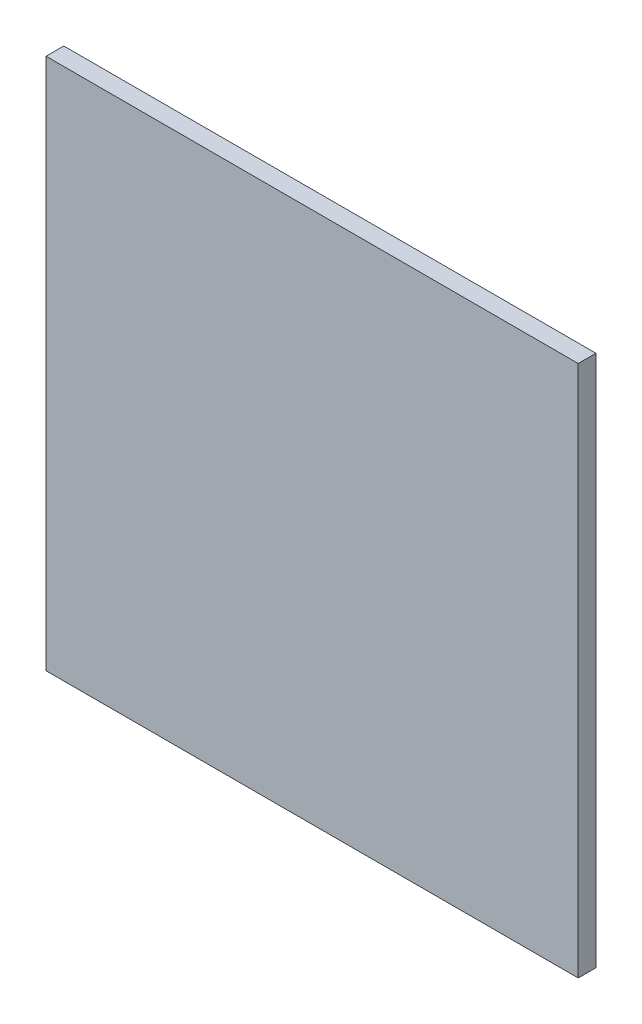
ISO-10303-21;
HEADER;
FILE_DESCRIPTION(('STEP AP214'),'2;1');
FILE_NAME('part.step','',(''),(''),'','','');
FILE_SCHEMA(('AUTOMOTIVE_DESIGN { 1 0 10303 214 1 1 1 1 }'));
ENDSEC;
DATA;
#1=APPLICATION_CONTEXT('core data for automotive mechanical design processes');
#2=APPLICATION_PROTOCOL_DEFINITION('international standard','automotive_design',2000,#1);
#3=PRODUCT_CONTEXT('',#1,'mechanical');
#4=PRODUCT('Part','Part','',(#3));
#5=PRODUCT_RELATED_PRODUCT_CATEGORY('part','',(#4));
#6=PRODUCT_DEFINITION_FORMATION('','',#4);
#7=PRODUCT_DEFINITION_CONTEXT('part definition',#1,'design');
#8=PRODUCT_DEFINITION('design','',#6,#7);
#9=PRODUCT_DEFINITION_SHAPE('','',#8);
#10=(LENGTH_UNIT() NAMED_UNIT(*) SI_UNIT(.MILLI.,.METRE.));
#11=(NAMED_UNIT(*) PLANE_ANGLE_UNIT() SI_UNIT($,.RADIAN.));
#12=(NAMED_UNIT(*) SI_UNIT($,.STERADIAN.) SOLID_ANGLE_UNIT());
#13=UNCERTAINTY_MEASURE_WITH_UNIT(LENGTH_MEASURE(1.E-05),#10,'distance_accuracy_value','');
#14=(GEOMETRIC_REPRESENTATION_CONTEXT(3) GLOBAL_UNCERTAINTY_ASSIGNED_CONTEXT((#13)) GLOBAL_UNIT_ASSIGNED_CONTEXT((#10,
#11,#12)) REPRESENTATION_CONTEXT('',''));
#15=CARTESIAN_POINT('',(0.,0.,0.));
#16=DIRECTION('',(0.,0.,1.));
#17=DIRECTION('',(1.,0.,0.));
#18=AXIS2_PLACEMENT_3D('',#15,#16,#17);
#19=CARTESIAN_POINT('',(1100.,-90.,3.));
#20=DIRECTION('',(-1.,0.,0.));
#21=DIRECTION('',(0.,0.,1.));
#22=AXIS2_PLACEMENT_3D('',#19,#20,#21);
#23=PLANE('',#22);
#24=DIRECTION('',(0.,1.,0.));
#25=VECTOR('',#24,1.);
#26=CARTESIAN_POINT('',(1100.,-90.,0.));
#27=LINE('',#26,#25);
#28=CARTESIAN_POINT('',(1100.,-90.,0.));
#29=VERTEX_POINT('',#28);
#30=CARTESIAN_POINT('',(1100.,0.,0.));
#31=VERTEX_POINT('',#30);
#32=EDGE_CURVE('E97',#29,#31,#27,.T.);
#33=ORIENTED_EDGE('',*,*,#32,.T.);
#34=DIRECTION('',(0.,0.,-1.));
#35=VECTOR('',#34,1.);
#36=CARTESIAN_POINT('',(1100.,0.,3.));
#37=LINE('',#36,#35);
#38=CARTESIAN_POINT('',(1100.,0.,3.));
#39=VERTEX_POINT('',#38);
#40=EDGE_CURVE('E11',#39,#31,#37,.T.);
#41=ORIENTED_EDGE('',*,*,#40,.F.);
#42=DIRECTION('',(0.,1.,0.));
#43=VECTOR('',#42,1.);
#44=CARTESIAN_POINT('',(1100.,-90.,3.));
#45=LINE('',#44,#43);
#46=CARTESIAN_POINT('',(1100.,-90.,3.));
#47=VERTEX_POINT('',#46);
#48=EDGE_CURVE('E85',#47,#39,#45,.T.);
#49=ORIENTED_EDGE('',*,*,#48,.F.);
#50=DIRECTION('',(0.,0.,-1.));
#51=VECTOR('',#50,1.);
#52=CARTESIAN_POINT('',(1100.,-90.,3.));
#53=LINE('',#52,#51);
#54=EDGE_CURVE('E93',#47,#29,#53,.T.);
#55=ORIENTED_EDGE('',*,*,#54,.T.);
#56=EDGE_LOOP('',(#33,#41,#49,#55));
#57=FACE_BOUND('',#56,.T.);
#58=ADVANCED_FACE('F34',(#57),#23,.F.);
#59=CARTESIAN_POINT('',(1100.,0.,3.));
#60=DIRECTION('',(0.,-1.,0.));
#61=DIRECTION('',(0.,0.,-1.));
#62=AXIS2_PLACEMENT_3D('',#59,#60,#61);
#63=PLANE('',#62);
#64=DIRECTION('',(-1.,0.,0.));
#65=VECTOR('',#64,1.);
#66=CARTESIAN_POINT('',(1100.,0.,0.));
#67=LINE('',#66,#65);
#68=CARTESIAN_POINT('',(1010.,0.,0.));
#69=VERTEX_POINT('',#68);
#70=EDGE_CURVE('E89',#31,#69,#67,.T.);
#71=ORIENTED_EDGE('',*,*,#70,.T.);
#72=DIRECTION('',(0.,0.,-1.));
#73=VECTOR('',#72,1.);
#74=CARTESIAN_POINT('',(1010.,0.,3.));
#75=LINE('',#74,#73);
#76=CARTESIAN_POINT('',(1010.,0.,3.));
#77=VERTEX_POINT('',#76);
#78=EDGE_CURVE('E42',#77,#69,#75,.T.);
#79=ORIENTED_EDGE('',*,*,#78,.F.);
#80=DIRECTION('',(-1.,0.,0.));
#81=VECTOR('',#80,1.);
#82=CARTESIAN_POINT('',(1100.,0.,3.));
#83=LINE('',#82,#81);
#84=EDGE_CURVE('E80',#39,#77,#83,.T.);
#85=ORIENTED_EDGE('',*,*,#84,.F.);
#86=ORIENTED_EDGE('',*,*,#40,.T.);
#87=EDGE_LOOP('',(#71,#79,#85,#86));
#88=FACE_BOUND('',#87,.T.);
#89=ADVANCED_FACE('F88',(#88),#63,.F.);
#90=CARTESIAN_POINT('',(1010.,-90.,3.));
#91=DIRECTION('',(1.,0.,0.));
#92=DIRECTION('',(0.,0.,-1.));
#93=AXIS2_PLACEMENT_3D('',#90,#91,#92);
#94=PLANE('',#93);
#95=DIRECTION('',(0.,-1.,0.));
#96=VECTOR('',#95,1.);
#97=CARTESIAN_POINT('',(1010.,-90.,0.));
#98=LINE('',#97,#96);
#99=CARTESIAN_POINT('',(1010.,-90.,0.));
#100=VERTEX_POINT('',#99);
#101=EDGE_CURVE('E67',#69,#100,#98,.T.);
#102=ORIENTED_EDGE('',*,*,#101,.T.);
#103=DIRECTION('',(0.,0.,-1.));
#104=VECTOR('',#103,1.);
#105=CARTESIAN_POINT('',(1010.,-90.,3.));
#106=LINE('',#105,#104);
#107=CARTESIAN_POINT('',(1010.,-90.,3.));
#108=VERTEX_POINT('',#107);
#109=EDGE_CURVE('E90',#108,#100,#106,.T.);
#110=ORIENTED_EDGE('',*,*,#109,.F.);
#111=DIRECTION('',(0.,-1.,0.));
#112=VECTOR('',#111,1.);
#113=CARTESIAN_POINT('',(1010.,-90.,3.));
#114=LINE('',#113,#112);
#115=EDGE_CURVE('E83',#77,#108,#114,.T.);
#116=ORIENTED_EDGE('',*,*,#115,.F.);
#117=ORIENTED_EDGE('',*,*,#78,.T.);
#118=EDGE_LOOP('',(#102,#110,#116,#117));
#119=FACE_BOUND('',#118,.T.);
#120=ADVANCED_FACE('F91',(#119),#94,.F.);
#121=CARTESIAN_POINT('',(1100.,-90.,3.));
#122=DIRECTION('',(0.,1.,0.));
#123=DIRECTION('',(-1.,0.,0.));
#124=AXIS2_PLACEMENT_3D('',#121,#122,#123);
#125=PLANE('',#124);
#126=DIRECTION('',(1.,0.,0.));
#127=VECTOR('',#126,1.);
#128=CARTESIAN_POINT('',(1100.,-90.,0.));
#129=LINE('',#128,#127);
#130=EDGE_CURVE('E73',#100,#29,#129,.T.);
#131=ORIENTED_EDGE('',*,*,#130,.T.);
#132=ORIENTED_EDGE('',*,*,#54,.F.);
#133=DIRECTION('',(1.,0.,0.));
#134=VECTOR('',#133,1.);
#135=CARTESIAN_POINT('',(1100.,-90.,3.));
#136=LINE('',#135,#134);
#137=EDGE_CURVE('E50',#108,#47,#136,.T.);
#138=ORIENTED_EDGE('',*,*,#137,.F.);
#139=ORIENTED_EDGE('',*,*,#109,.T.);
#140=EDGE_LOOP('',(#131,#132,#138,#139));
#141=FACE_BOUND('',#140,.T.);
#142=ADVANCED_FACE('F104',(#141),#125,.F.);
#143=CARTESIAN_POINT('',(0.,0.,3.));
#144=DIRECTION('',(0.,0.,1.));
#145=DIRECTION('',(1.,0.,0.));
#146=AXIS2_PLACEMENT_3D('',#143,#144,#145);
#147=PLANE('',#146);
#148=ORIENTED_EDGE('',*,*,#48,.T.);
#149=ORIENTED_EDGE('',*,*,#84,.T.);
#150=ORIENTED_EDGE('',*,*,#115,.T.);
#151=ORIENTED_EDGE('',*,*,#137,.T.);
#152=EDGE_LOOP('',(#148,#149,#150,#151));
#153=FACE_BOUND('',#152,.T.);
#154=ADVANCED_FACE('F81',(#153),#147,.T.);
#155=CARTESIAN_POINT('',(0.,0.,0.));
#156=DIRECTION('',(0.,0.,1.));
#157=DIRECTION('',(1.,0.,0.));
#158=AXIS2_PLACEMENT_3D('',#155,#156,#157);
#159=PLANE('',#158);
#160=ORIENTED_EDGE('',*,*,#32,.F.);
#161=ORIENTED_EDGE('',*,*,#130,.F.);
#162=ORIENTED_EDGE('',*,*,#101,.F.);
#163=ORIENTED_EDGE('',*,*,#70,.F.);
#164=EDGE_LOOP('',(#160,#161,#162,#163));
#165=FACE_BOUND('',#164,.T.);
#166=ADVANCED_FACE('F107',(#165),#159,.F.);
#167=CLOSED_SHELL('',(#58,#89,#120,#142,#154,#166));
#168=MANIFOLD_SOLID_BREP('B2',#167);
#169=ADVANCED_BREP_SHAPE_REPRESENTATION('',(#18,#168),#14);
#170=SHAPE_DEFINITION_REPRESENTATION(#9,#169);
ENDSEC;
END-ISO-10303-21;
